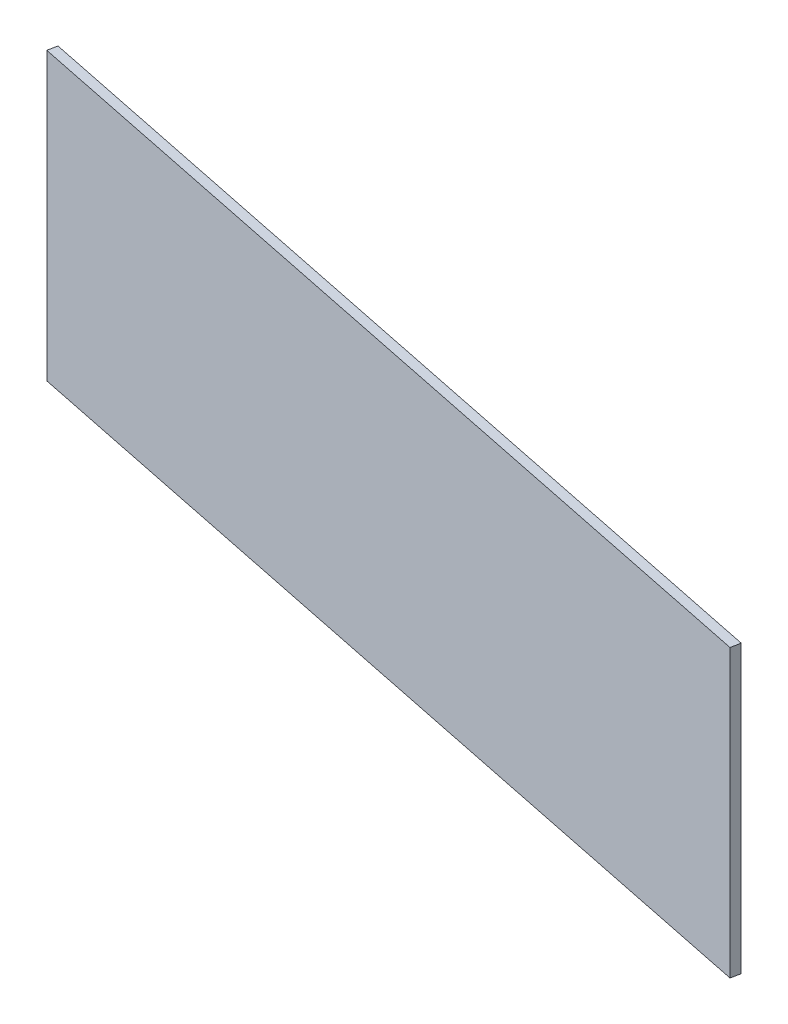
ISO-10303-21;
HEADER;
FILE_DESCRIPTION(('STEP AP214'),'2;1');
FILE_NAME('part.step','',(''),(''),'','','');
FILE_SCHEMA(('AUTOMOTIVE_DESIGN { 1 0 10303 214 1 1 1 1 }'));
ENDSEC;
DATA;
#1=APPLICATION_CONTEXT('core data for automotive mechanical design processes');
#2=APPLICATION_PROTOCOL_DEFINITION('international standard','automotive_design',2000,#1);
#3=PRODUCT_CONTEXT('',#1,'mechanical');
#4=PRODUCT('Part','Part','',(#3));
#5=PRODUCT_RELATED_PRODUCT_CATEGORY('part','',(#4));
#6=PRODUCT_DEFINITION_FORMATION('','',#4);
#7=PRODUCT_DEFINITION_CONTEXT('part definition',#1,'design');
#8=PRODUCT_DEFINITION('design','',#6,#7);
#9=PRODUCT_DEFINITION_SHAPE('','',#8);
#10=(LENGTH_UNIT() NAMED_UNIT(*) SI_UNIT(.MILLI.,.METRE.));
#11=(NAMED_UNIT(*) PLANE_ANGLE_UNIT() SI_UNIT($,.RADIAN.));
#12=(NAMED_UNIT(*) SI_UNIT($,.STERADIAN.) SOLID_ANGLE_UNIT());
#13=UNCERTAINTY_MEASURE_WITH_UNIT(LENGTH_MEASURE(1.E-05),#10,'distance_accuracy_value','');
#14=(GEOMETRIC_REPRESENTATION_CONTEXT(3) GLOBAL_UNCERTAINTY_ASSIGNED_CONTEXT((#13)) GLOBAL_UNIT_ASSIGNED_CONTEXT((#10,
#11,#12)) REPRESENTATION_CONTEXT('',''));
#15=CARTESIAN_POINT('',(0.,0.,0.));
#16=DIRECTION('',(0.,0.,1.));
#17=DIRECTION('',(1.,0.,0.));
#18=AXIS2_PLACEMENT_3D('',#15,#16,#17);
#19=CARTESIAN_POINT('',(1.5,0.29,-1.315));
#20=DIRECTION('',(-0.200278154070654,0.,0.979739078021312));
#21=DIRECTION('',(-0.979739078021312,0.,-0.200278154070654));
#22=AXIS2_PLACEMENT_3D('',#19,#20,#21);
#23=PLANE('',#22);
#24=DIRECTION('',(0.979739078021312,0.,0.200278154070654));
#25=VECTOR('',#24,1.);
#26=CARTESIAN_POINT('',(0.599999999999999,-0.00999999999999999,-1.49897790055248));
#27=LINE('',#26,#25);
#28=CARTESIAN_POINT('',(0.600000000000001,-0.01,-1.49897790055249));
#29=VERTEX_POINT('',#28);
#30=CARTESIAN_POINT('',(1.5,-0.01,-1.315));
#31=VERTEX_POINT('',#30);
#32=EDGE_CURVE('E11',#29,#31,#27,.T.);
#33=ORIENTED_EDGE('',*,*,#32,.T.);
#34=DIRECTION('',(0.,-1.,0.));
#35=VECTOR('',#34,1.);
#36=CARTESIAN_POINT('',(1.5,0.29,-1.315));
#37=LINE('',#36,#35);
#38=CARTESIAN_POINT('',(1.5,0.29,-1.315));
#39=VERTEX_POINT('',#38);
#40=EDGE_CURVE('E24',#39,#31,#37,.T.);
#41=ORIENTED_EDGE('',*,*,#40,.F.);
#42=DIRECTION('',(0.979739078021312,0.,0.200278154070655));
#43=VECTOR('',#42,1.);
#44=CARTESIAN_POINT('',(0.600000000000001,0.29,-1.49897790055249));
#45=LINE('',#44,#43);
#46=CARTESIAN_POINT('',(0.600000000000001,0.29,-1.49897790055249));
#47=VERTEX_POINT('',#46);
#48=EDGE_CURVE('E60',#47,#39,#45,.T.);
#49=ORIENTED_EDGE('',*,*,#48,.F.);
#50=DIRECTION('',(0.,1.,0.));
#51=VECTOR('',#50,1.);
#52=CARTESIAN_POINT('',(0.600000000000001,-0.01,-1.49897790055249));
#53=LINE('',#52,#51);
#54=EDGE_CURVE('E88',#29,#47,#53,.T.);
#55=ORIENTED_EDGE('',*,*,#54,.F.);
#56=EDGE_LOOP('',(#33,#41,#49,#55));
#57=FACE_BOUND('',#56,.T.);
#58=ADVANCED_FACE('F17',(#57),#23,.T.);
#59=CARTESIAN_POINT('',(0.,-0.01,0.));
#60=DIRECTION('',(0.,-1.,0.));
#61=DIRECTION('',(0.,0.,-1.));
#62=AXIS2_PLACEMENT_3D('',#59,#60,#61);
#63=PLANE('',#62);
#64=ORIENTED_EDGE('',*,*,#32,.F.);
#65=DIRECTION('',(-0.200278154070647,0.,0.979739078021314));
#66=VECTOR('',#65,1.);
#67=CARTESIAN_POINT('',(0.602002781540707,-0.01,-1.5087752913327));
#68=LINE('',#67,#66);
#69=CARTESIAN_POINT('',(0.602002781540707,-0.01,-1.5087752913327));
#70=VERTEX_POINT('',#69);
#71=EDGE_CURVE('E85',#70,#29,#68,.T.);
#72=ORIENTED_EDGE('',*,*,#71,.F.);
#73=DIRECTION('',(-0.979739078021312,0.,-0.200278154070655));
#74=VECTOR('',#73,1.);
#75=CARTESIAN_POINT('',(1.50200278154071,-0.0100000000000001,-1.32479739078021));
#76=LINE('',#75,#74);
#77=CARTESIAN_POINT('',(1.50200278154071,-0.0100000000000001,-1.32479739078021));
#78=VERTEX_POINT('',#77);
#79=EDGE_CURVE('E63',#78,#70,#76,.T.);
#80=ORIENTED_EDGE('',*,*,#79,.F.);
#81=DIRECTION('',(-0.200278154070649,0.,0.979739078021313));
#82=VECTOR('',#81,1.);
#83=CARTESIAN_POINT('',(1.50200278154071,-0.0100000000000001,-1.32479739078021));
#84=LINE('',#83,#82);
#85=EDGE_CURVE('E73',#78,#31,#84,.T.);
#86=ORIENTED_EDGE('',*,*,#85,.T.);
#87=EDGE_LOOP('',(#64,#72,#80,#86));
#88=FACE_BOUND('',#87,.T.);
#89=ADVANCED_FACE('F89',(#88),#63,.T.);
#90=CARTESIAN_POINT('',(0.602002781540707,-0.01,-1.5087752913327));
#91=DIRECTION('',(0.979739078021312,0.,0.200278154070655));
#92=DIRECTION('',(0.200278154070655,0.,-0.979739078021312));
#93=AXIS2_PLACEMENT_3D('',#90,#91,#92);
#94=PLANE('',#93);
#95=ORIENTED_EDGE('',*,*,#54,.T.);
#96=DIRECTION('',(-0.200278154070647,0.,0.979739078021314));
#97=VECTOR('',#96,1.);
#98=CARTESIAN_POINT('',(0.602002781540707,0.29,-1.5087752913327));
#99=LINE('',#98,#97);
#100=CARTESIAN_POINT('',(0.602002781540707,0.29,-1.5087752913327));
#101=VERTEX_POINT('',#100);
#102=EDGE_CURVE('E82',#101,#47,#99,.T.);
#103=ORIENTED_EDGE('',*,*,#102,.F.);
#104=DIRECTION('',(0.,1.,0.));
#105=VECTOR('',#104,1.);
#106=CARTESIAN_POINT('',(0.602002781540707,-0.01,-1.5087752913327));
#107=LINE('',#106,#105);
#108=EDGE_CURVE('E64',#70,#101,#107,.T.);
#109=ORIENTED_EDGE('',*,*,#108,.F.);
#110=ORIENTED_EDGE('',*,*,#71,.T.);
#111=EDGE_LOOP('',(#95,#103,#109,#110));
#112=FACE_BOUND('',#111,.T.);
#113=ADVANCED_FACE('F91',(#112),#94,.F.);
#114=CARTESIAN_POINT('',(0.602002781540707,0.29,-1.5087752913327));
#115=DIRECTION('',(0.,-1.,0.));
#116=DIRECTION('',(1.,0.,0.));
#117=AXIS2_PLACEMENT_3D('',#114,#115,#116);
#118=PLANE('',#117);
#119=ORIENTED_EDGE('',*,*,#48,.T.);
#120=DIRECTION('',(-0.200278154070649,0.,0.979739078021313));
#121=VECTOR('',#120,1.);
#122=CARTESIAN_POINT('',(1.50200278154071,0.29,-1.32479739078021));
#123=LINE('',#122,#121);
#124=CARTESIAN_POINT('',(1.50200278154071,0.29,-1.32479739078021));
#125=VERTEX_POINT('',#124);
#126=EDGE_CURVE('E54',#125,#39,#123,.T.);
#127=ORIENTED_EDGE('',*,*,#126,.F.);
#128=DIRECTION('',(0.979739078021312,0.,0.200278154070655));
#129=VECTOR('',#128,1.);
#130=CARTESIAN_POINT('',(0.602002781540707,0.29,-1.5087752913327));
#131=LINE('',#130,#129);
#132=EDGE_CURVE('E58',#101,#125,#131,.T.);
#133=ORIENTED_EDGE('',*,*,#132,.F.);
#134=ORIENTED_EDGE('',*,*,#102,.T.);
#135=EDGE_LOOP('',(#119,#127,#133,#134));
#136=FACE_BOUND('',#135,.T.);
#137=ADVANCED_FACE('F56',(#136),#118,.F.);
#138=CARTESIAN_POINT('',(1.50200278154071,-0.0100000000000001,-1.32479739078021));
#139=DIRECTION('',(-0.979739078021312,0.,-0.200278154070655));
#140=DIRECTION('',(-0.200278154070655,0.,0.979739078021312));
#141=AXIS2_PLACEMENT_3D('',#138,#139,#140);
#142=PLANE('',#141);
#143=ORIENTED_EDGE('',*,*,#40,.T.);
#144=ORIENTED_EDGE('',*,*,#85,.F.);
#145=DIRECTION('',(0.,-1.,0.));
#146=VECTOR('',#145,1.);
#147=CARTESIAN_POINT('',(1.50200278154071,0.29,-1.32479739078021));
#148=LINE('',#147,#146);
#149=EDGE_CURVE('E71',#125,#78,#148,.T.);
#150=ORIENTED_EDGE('',*,*,#149,.F.);
#151=ORIENTED_EDGE('',*,*,#126,.T.);
#152=EDGE_LOOP('',(#143,#144,#150,#151));
#153=FACE_BOUND('',#152,.T.);
#154=ADVANCED_FACE('F76',(#153),#142,.F.);
#155=CARTESIAN_POINT('',(0.320199529269977,0.,-1.5663814810234));
#156=DIRECTION('',(0.200278154070655,0.,-0.979739078021312));
#157=DIRECTION('',(-0.979739078021312,0.,-0.200278154070655));
#158=AXIS2_PLACEMENT_3D('',#155,#156,#157);
#159=PLANE('',#158);
#160=ORIENTED_EDGE('',*,*,#108,.T.);
#161=ORIENTED_EDGE('',*,*,#132,.T.);
#162=ORIENTED_EDGE('',*,*,#149,.T.);
#163=ORIENTED_EDGE('',*,*,#79,.T.);
#164=EDGE_LOOP('',(#160,#161,#162,#163));
#165=FACE_BOUND('',#164,.T.);
#166=ADVANCED_FACE('F69',(#165),#159,.T.);
#167=CLOSED_SHELL('',(#58,#89,#113,#137,#154,#166));
#168=MANIFOLD_SOLID_BREP('B1',#167);
#169=ADVANCED_BREP_SHAPE_REPRESENTATION('',(#18,#168),#14);
#170=SHAPE_DEFINITION_REPRESENTATION(#9,#169);
ENDSEC;
END-ISO-10303-21;
